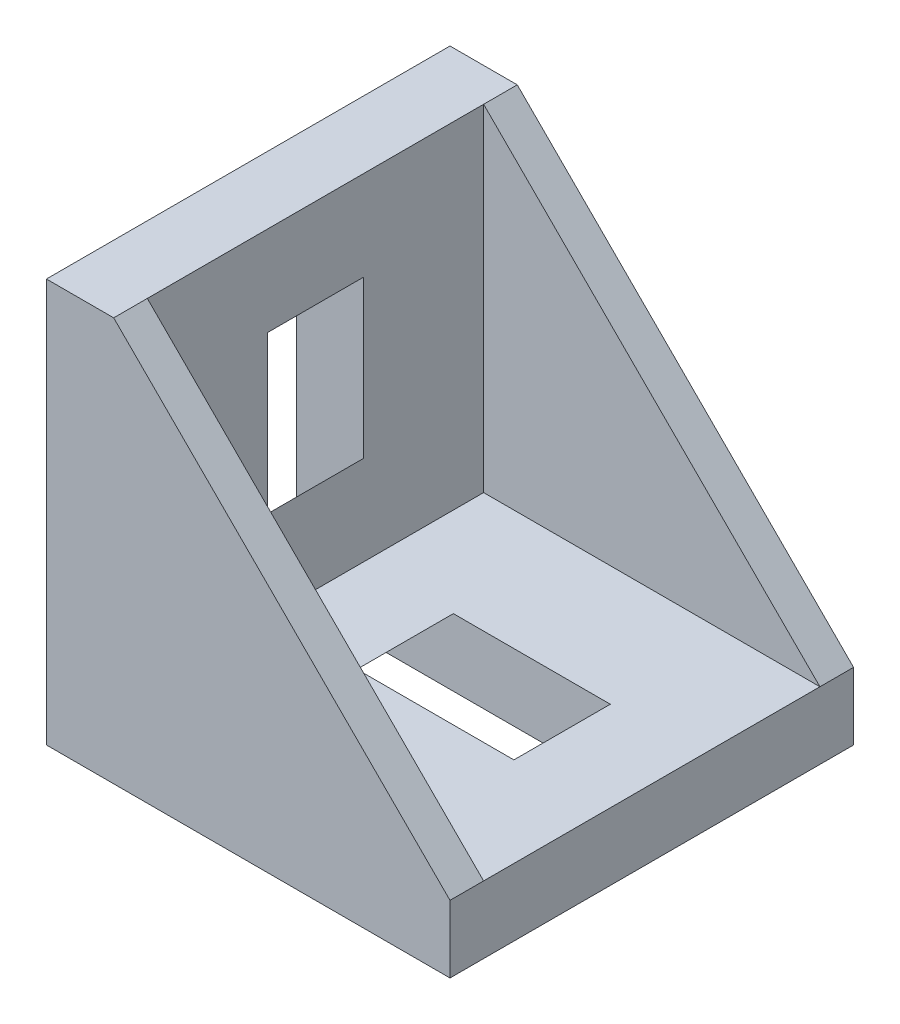
ISO-10303-21;
HEADER;
FILE_DESCRIPTION(('STEP AP214'),'2;1');
FILE_NAME('part.step','',(''),(''),'','','');
FILE_SCHEMA(('AUTOMOTIVE_DESIGN { 1 0 10303 214 1 1 1 1 }'));
ENDSEC;
DATA;
#1=APPLICATION_CONTEXT('core data for automotive mechanical design processes');
#2=APPLICATION_PROTOCOL_DEFINITION('international standard','automotive_design',2000,#1);
#3=PRODUCT_CONTEXT('',#1,'mechanical');
#4=PRODUCT('Part','Part','',(#3));
#5=PRODUCT_RELATED_PRODUCT_CATEGORY('part','',(#4));
#6=PRODUCT_DEFINITION_FORMATION('','',#4);
#7=PRODUCT_DEFINITION_CONTEXT('part definition',#1,'design');
#8=PRODUCT_DEFINITION('design','',#6,#7);
#9=PRODUCT_DEFINITION_SHAPE('','',#8);
#10=(LENGTH_UNIT() NAMED_UNIT(*) SI_UNIT(.MILLI.,.METRE.));
#11=(NAMED_UNIT(*) PLANE_ANGLE_UNIT() SI_UNIT($,.RADIAN.));
#12=(NAMED_UNIT(*) SI_UNIT($,.STERADIAN.) SOLID_ANGLE_UNIT());
#13=UNCERTAINTY_MEASURE_WITH_UNIT(LENGTH_MEASURE(1.E-05),#10,'distance_accuracy_value','');
#14=(GEOMETRIC_REPRESENTATION_CONTEXT(3) GLOBAL_UNCERTAINTY_ASSIGNED_CONTEXT((#13)) GLOBAL_UNIT_ASSIGNED_CONTEXT((#10,
#11,#12)) REPRESENTATION_CONTEXT('',''));
#15=CARTESIAN_POINT('',(0.,0.,0.));
#16=DIRECTION('',(0.,0.,1.));
#17=DIRECTION('',(1.,0.,0.));
#18=AXIS2_PLACEMENT_3D('',#15,#16,#17);
#19=CARTESIAN_POINT('',(0.,0.,9.));
#20=DIRECTION('',(1.,0.,0.));
#21=DIRECTION('',(0.,0.,-1.));
#22=AXIS2_PLACEMENT_3D('',#19,#20,#21);
#23=PLANE('',#22);
#24=DIRECTION('',(0.,0.,-1.));
#25=VECTOR('',#24,1.);
#26=CARTESIAN_POINT('',(0.,17.3,2.5));
#27=LINE('',#26,#25);
#28=CARTESIAN_POINT('',(0.,17.3,2.5));
#29=VERTEX_POINT('',#28);
#30=CARTESIAN_POINT('',(0.,17.3,-2.5));
#31=VERTEX_POINT('',#30);
#32=EDGE_CURVE('E288',#29,#31,#27,.T.);
#33=ORIENTED_EDGE('',*,*,#32,.F.);
#34=DIRECTION('',(0.,1.,0.));
#35=VECTOR('',#34,1.);
#36=CARTESIAN_POINT('',(0.,17.3,2.5));
#37=LINE('',#36,#35);
#38=CARTESIAN_POINT('',(0.,14.9992165715514,2.5));
#39=VERTEX_POINT('',#38);
#40=EDGE_CURVE('E285',#39,#29,#37,.T.);
#41=ORIENTED_EDGE('',*,*,#40,.F.);
#42=DIRECTION('',(0.,0.,-1.));
#43=VECTOR('',#42,1.);
#44=CARTESIAN_POINT('',(0.,14.9992165715514,2.5));
#45=LINE('',#44,#43);
#46=CARTESIAN_POINT('',(0.,14.9992165715514,-2.5));
#47=VERTEX_POINT('',#46);
#48=EDGE_CURVE('E299',#39,#47,#45,.T.);
#49=ORIENTED_EDGE('',*,*,#48,.T.);
#50=DIRECTION('',(0.,1.,0.));
#51=VECTOR('',#50,1.);
#52=CARTESIAN_POINT('',(0.,17.3,-2.5));
#53=LINE('',#52,#51);
#54=EDGE_CURVE('E280',#47,#31,#53,.T.);
#55=ORIENTED_EDGE('',*,*,#54,.T.);
#56=EDGE_LOOP('',(#33,#41,#49,#55));
#57=FACE_BOUND('',#56,.T.);
#58=DIRECTION('',(0.,-1.,0.));
#59=VECTOR('',#58,1.);
#60=CARTESIAN_POINT('',(0.,14.,-2.15));
#61=LINE('',#60,#59);
#62=CARTESIAN_POINT('',(0.,14.,-2.15));
#63=VERTEX_POINT('',#62);
#64=CARTESIAN_POINT('',(0.,4.,-2.15));
#65=VERTEX_POINT('',#64);
#66=EDGE_CURVE('E402',#63,#65,#61,.T.);
#67=ORIENTED_EDGE('',*,*,#66,.F.);
#68=DIRECTION('',(0.,0.,1.));
#69=VECTOR('',#68,1.);
#70=CARTESIAN_POINT('',(0.,14.,-2.15));
#71=LINE('',#70,#69);
#72=CARTESIAN_POINT('',(0.,14.,2.15));
#73=VERTEX_POINT('',#72);
#74=EDGE_CURVE('E425',#63,#73,#71,.T.);
#75=ORIENTED_EDGE('',*,*,#74,.T.);
#76=DIRECTION('',(0.,-1.,0.));
#77=VECTOR('',#76,1.);
#78=CARTESIAN_POINT('',(0.,14.,2.15));
#79=LINE('',#78,#77);
#80=CARTESIAN_POINT('',(0.,4.,2.15));
#81=VERTEX_POINT('',#80);
#82=EDGE_CURVE('E393',#73,#81,#79,.T.);
#83=ORIENTED_EDGE('',*,*,#82,.T.);
#84=DIRECTION('',(0.,0.,1.));
#85=VECTOR('',#84,1.);
#86=CARTESIAN_POINT('',(0.,4.,-2.15));
#87=LINE('',#86,#85);
#88=EDGE_CURVE('E414',#65,#81,#87,.T.);
#89=ORIENTED_EDGE('',*,*,#88,.F.);
#90=EDGE_LOOP('',(#67,#75,#83,#89));
#91=FACE_BOUND('',#90,.T.);
#92=DIRECTION('',(0.,-1.,0.));
#93=VECTOR('',#92,1.);
#94=CARTESIAN_POINT('',(0.,0.,-9.));
#95=LINE('',#94,#93);
#96=CARTESIAN_POINT('',(0.,18.,-9.));
#97=VERTEX_POINT('',#96);
#98=CARTESIAN_POINT('',(0.,0.,-9.));
#99=VERTEX_POINT('',#98);
#100=EDGE_CURVE('E465',#97,#99,#95,.T.);
#101=ORIENTED_EDGE('',*,*,#100,.T.);
#102=DIRECTION('',(0.,0.,-1.));
#103=VECTOR('',#102,1.);
#104=CARTESIAN_POINT('',(0.,0.,9.));
#105=LINE('',#104,#103);
#106=CARTESIAN_POINT('',(0.,0.,9.));
#107=VERTEX_POINT('',#106);
#108=EDGE_CURVE('E473',#107,#99,#105,.T.);
#109=ORIENTED_EDGE('',*,*,#108,.F.);
#110=DIRECTION('',(0.,-1.,0.));
#111=VECTOR('',#110,1.);
#112=CARTESIAN_POINT('',(0.,0.,9.));
#113=LINE('',#112,#111);
#114=CARTESIAN_POINT('',(0.,18.,9.));
#115=VERTEX_POINT('',#114);
#116=EDGE_CURVE('E471',#115,#107,#113,.T.);
#117=ORIENTED_EDGE('',*,*,#116,.F.);
#118=DIRECTION('',(0.,0.,-1.));
#119=VECTOR('',#118,1.);
#120=CARTESIAN_POINT('',(0.,18.,9.));
#121=LINE('',#120,#119);
#122=EDGE_CURVE('E487',#115,#97,#121,.T.);
#123=ORIENTED_EDGE('',*,*,#122,.T.);
#124=EDGE_LOOP('',(#101,#109,#117,#123));
#125=FACE_BOUND('',#124,.T.);
#126=DIRECTION('',(0.,1.,0.));
#127=VECTOR('',#126,1.);
#128=CARTESIAN_POINT('',(0.,1.23475047748417,2.5));
#129=LINE('',#128,#127);
#130=CARTESIAN_POINT('',(0.,1.23475047748417,2.5));
#131=VERTEX_POINT('',#130);
#132=CARTESIAN_POINT('',(0.,3.53553390593273,2.5));
#133=VERTEX_POINT('',#132);
#134=EDGE_CURVE('E308',#131,#133,#129,.T.);
#135=ORIENTED_EDGE('',*,*,#134,.F.);
#136=DIRECTION('',(0.,0.,-1.));
#137=VECTOR('',#136,1.);
#138=CARTESIAN_POINT('',(0.,1.23475047748417,2.5));
#139=LINE('',#138,#137);
#140=CARTESIAN_POINT('',(0.,1.23475047748417,-2.5));
#141=VERTEX_POINT('',#140);
#142=EDGE_CURVE('E318',#131,#141,#139,.T.);
#143=ORIENTED_EDGE('',*,*,#142,.T.);
#144=DIRECTION('',(0.,1.,0.));
#145=VECTOR('',#144,1.);
#146=CARTESIAN_POINT('',(0.,1.23475047748417,-2.5));
#147=LINE('',#146,#145);
#148=CARTESIAN_POINT('',(0.,3.53553390593273,-2.5));
#149=VERTEX_POINT('',#148);
#150=EDGE_CURVE('E307',#141,#149,#147,.T.);
#151=ORIENTED_EDGE('',*,*,#150,.T.);
#152=DIRECTION('',(0.,0.,-1.));
#153=VECTOR('',#152,1.);
#154=CARTESIAN_POINT('',(0.,3.53553390593273,2.5));
#155=LINE('',#154,#153);
#156=EDGE_CURVE('E334',#133,#149,#155,.T.);
#157=ORIENTED_EDGE('',*,*,#156,.F.);
#158=EDGE_LOOP('',(#135,#143,#151,#157));
#159=FACE_BOUND('',#158,.T.);
#160=ADVANCED_FACE('F32',(#57,#91,#125,#159),#23,.F.);
#161=CARTESIAN_POINT('',(18.,0.,9.));
#162=DIRECTION('',(0.,1.,0.));
#163=DIRECTION('',(-1.,0.,0.));
#164=AXIS2_PLACEMENT_3D('',#161,#162,#163);
#165=PLANE('',#164);
#166=DIRECTION('',(0.,0.,-1.));
#167=VECTOR('',#166,1.);
#168=CARTESIAN_POINT('',(14.9992165715514,0.,2.5));
#169=LINE('',#168,#167);
#170=CARTESIAN_POINT('',(14.9992165715514,0.,2.5));
#171=VERTEX_POINT('',#170);
#172=CARTESIAN_POINT('',(14.9992165715514,0.,-2.5));
#173=VERTEX_POINT('',#172);
#174=EDGE_CURVE('E47',#171,#173,#169,.T.);
#175=ORIENTED_EDGE('',*,*,#174,.F.);
#176=DIRECTION('',(-1.,0.,0.));
#177=VECTOR('',#176,1.);
#178=CARTESIAN_POINT('',(17.3,0.,2.5));
#179=LINE('',#178,#177);
#180=CARTESIAN_POINT('',(17.3,0.,2.5));
#181=VERTEX_POINT('',#180);
#182=EDGE_CURVE('E52',#181,#171,#179,.T.);
#183=ORIENTED_EDGE('',*,*,#182,.F.);
#184=DIRECTION('',(0.,0.,-1.));
#185=VECTOR('',#184,1.);
#186=CARTESIAN_POINT('',(17.3,0.,2.5));
#187=LINE('',#186,#185);
#188=CARTESIAN_POINT('',(17.3,0.,-2.5));
#189=VERTEX_POINT('',#188);
#190=EDGE_CURVE('E260',#181,#189,#187,.T.);
#191=ORIENTED_EDGE('',*,*,#190,.T.);
#192=DIRECTION('',(-1.,0.,0.));
#193=VECTOR('',#192,1.);
#194=CARTESIAN_POINT('',(17.3,0.,-2.5));
#195=LINE('',#194,#193);
#196=EDGE_CURVE('E264',#189,#173,#195,.T.);
#197=ORIENTED_EDGE('',*,*,#196,.T.);
#198=EDGE_LOOP('',(#175,#183,#191,#197));
#199=FACE_BOUND('',#198,.T.);
#200=DIRECTION('',(1.,0.,0.));
#201=VECTOR('',#200,1.);
#202=CARTESIAN_POINT('',(4.,0.,-2.15));
#203=LINE('',#202,#201);
#204=CARTESIAN_POINT('',(4.,0.,-2.15));
#205=VERTEX_POINT('',#204);
#206=CARTESIAN_POINT('',(14.,0.,-2.15));
#207=VERTEX_POINT('',#206);
#208=EDGE_CURVE('E370',#205,#207,#203,.T.);
#209=ORIENTED_EDGE('',*,*,#208,.F.);
#210=DIRECTION('',(0.,0.,1.));
#211=VECTOR('',#210,1.);
#212=CARTESIAN_POINT('',(4.,0.,-2.15));
#213=LINE('',#212,#211);
#214=CARTESIAN_POINT('',(4.,0.,2.15));
#215=VERTEX_POINT('',#214);
#216=EDGE_CURVE('E380',#205,#215,#213,.T.);
#217=ORIENTED_EDGE('',*,*,#216,.T.);
#218=DIRECTION('',(1.,0.,0.));
#219=VECTOR('',#218,1.);
#220=CARTESIAN_POINT('',(4.,0.,2.15));
#221=LINE('',#220,#219);
#222=CARTESIAN_POINT('',(14.,0.,2.15));
#223=VERTEX_POINT('',#222);
#224=EDGE_CURVE('E383',#215,#223,#221,.T.);
#225=ORIENTED_EDGE('',*,*,#224,.T.);
#226=DIRECTION('',(0.,0.,1.));
#227=VECTOR('',#226,1.);
#228=CARTESIAN_POINT('',(14.,0.,-2.15));
#229=LINE('',#228,#227);
#230=EDGE_CURVE('E397',#207,#223,#229,.T.);
#231=ORIENTED_EDGE('',*,*,#230,.F.);
#232=EDGE_LOOP('',(#209,#217,#225,#231));
#233=FACE_BOUND('',#232,.T.);
#234=DIRECTION('',(1.,0.,0.));
#235=VECTOR('',#234,1.);
#236=CARTESIAN_POINT('',(18.,0.,-9.));
#237=LINE('',#236,#235);
#238=CARTESIAN_POINT('',(18.,0.,-9.));
#239=VERTEX_POINT('',#238);
#240=EDGE_CURVE('E457',#99,#239,#237,.T.);
#241=ORIENTED_EDGE('',*,*,#240,.T.);
#242=DIRECTION('',(0.,0.,-1.));
#243=VECTOR('',#242,1.);
#244=CARTESIAN_POINT('',(18.,0.,9.));
#245=LINE('',#244,#243);
#246=CARTESIAN_POINT('',(18.,0.,9.));
#247=VERTEX_POINT('',#246);
#248=EDGE_CURVE('E11',#247,#239,#245,.T.);
#249=ORIENTED_EDGE('',*,*,#248,.F.);
#250=DIRECTION('',(1.,0.,0.));
#251=VECTOR('',#250,1.);
#252=CARTESIAN_POINT('',(18.,0.,9.));
#253=LINE('',#252,#251);
#254=EDGE_CURVE('E461',#107,#247,#253,.T.);
#255=ORIENTED_EDGE('',*,*,#254,.F.);
#256=ORIENTED_EDGE('',*,*,#108,.T.);
#257=EDGE_LOOP('',(#241,#249,#255,#256));
#258=FACE_BOUND('',#257,.T.);
#259=DIRECTION('',(-1.,0.,0.));
#260=VECTOR('',#259,1.);
#261=CARTESIAN_POINT('',(1.23475047748409,0.,2.5));
#262=LINE('',#261,#260);
#263=CARTESIAN_POINT('',(3.53553390593274,0.,2.5));
#264=VERTEX_POINT('',#263);
#265=CARTESIAN_POINT('',(1.23475047748409,0.,2.5));
#266=VERTEX_POINT('',#265);
#267=EDGE_CURVE('E339',#264,#266,#262,.T.);
#268=ORIENTED_EDGE('',*,*,#267,.F.);
#269=DIRECTION('',(0.,0.,-1.));
#270=VECTOR('',#269,1.);
#271=CARTESIAN_POINT('',(3.53553390593274,0.,2.5));
#272=LINE('',#271,#270);
#273=CARTESIAN_POINT('',(3.53553390593274,0.,-2.5));
#274=VERTEX_POINT('',#273);
#275=EDGE_CURVE('E363',#264,#274,#272,.T.);
#276=ORIENTED_EDGE('',*,*,#275,.T.);
#277=DIRECTION('',(-1.,0.,0.));
#278=VECTOR('',#277,1.);
#279=CARTESIAN_POINT('',(1.23475047748409,0.,-2.5));
#280=LINE('',#279,#278);
#281=CARTESIAN_POINT('',(1.23475047748409,0.,-2.5));
#282=VERTEX_POINT('',#281);
#283=EDGE_CURVE('E349',#274,#282,#280,.T.);
#284=ORIENTED_EDGE('',*,*,#283,.T.);
#285=DIRECTION('',(0.,0.,-1.));
#286=VECTOR('',#285,1.);
#287=CARTESIAN_POINT('',(1.23475047748409,0.,2.5));
#288=LINE('',#287,#286);
#289=EDGE_CURVE('E360',#266,#282,#288,.T.);
#290=ORIENTED_EDGE('',*,*,#289,.F.);
#291=EDGE_LOOP('',(#268,#276,#284,#290));
#292=FACE_BOUND('',#291,.T.);
#293=ADVANCED_FACE('F34',(#199,#233,#258,#292),#165,.F.);
#294=CARTESIAN_POINT('',(3.,3.,-7.5));
#295=DIRECTION('',(0.,-1.,0.));
#296=DIRECTION('',(0.,0.,-1.));
#297=AXIS2_PLACEMENT_3D('',#294,#295,#296);
#298=PLANE('',#297);
#299=DIRECTION('',(1.,0.,0.));
#300=VECTOR('',#299,1.);
#301=CARTESIAN_POINT('',(3.,3.,7.5));
#302=LINE('',#301,#300);
#303=CARTESIAN_POINT('',(3.,3.,7.5));
#304=VERTEX_POINT('',#303);
#305=CARTESIAN_POINT('',(18.,3.,7.5));
#306=VERTEX_POINT('',#305);
#307=EDGE_CURVE('E440',#304,#306,#302,.T.);
#308=ORIENTED_EDGE('',*,*,#307,.T.);
#309=DIRECTION('',(0.,0.,1.));
#310=VECTOR('',#309,1.);
#311=CARTESIAN_POINT('',(18.,3.,-7.5));
#312=LINE('',#311,#310);
#313=CARTESIAN_POINT('',(18.,3.,-7.5));
#314=VERTEX_POINT('',#313);
#315=EDGE_CURVE('E454',#314,#306,#312,.T.);
#316=ORIENTED_EDGE('',*,*,#315,.F.);
#317=DIRECTION('',(1.,0.,0.));
#318=VECTOR('',#317,1.);
#319=CARTESIAN_POINT('',(3.,3.,-7.5));
#320=LINE('',#319,#318);
#321=CARTESIAN_POINT('',(3.,3.,-7.5));
#322=VERTEX_POINT('',#321);
#323=EDGE_CURVE('E443',#322,#314,#320,.T.);
#324=ORIENTED_EDGE('',*,*,#323,.F.);
#325=DIRECTION('',(0.,0.,1.));
#326=VECTOR('',#325,1.);
#327=CARTESIAN_POINT('',(3.,3.,-7.5));
#328=LINE('',#327,#326);
#329=EDGE_CURVE('E458',#322,#304,#328,.T.);
#330=ORIENTED_EDGE('',*,*,#329,.T.);
#331=EDGE_LOOP('',(#308,#316,#324,#330));
#332=FACE_BOUND('',#331,.T.);
#333=DIRECTION('',(-1.,0.,0.));
#334=VECTOR('',#333,1.);
#335=CARTESIAN_POINT('',(7.,3.,-2.15));
#336=LINE('',#335,#334);
#337=CARTESIAN_POINT('',(14.,3.,-2.15));
#338=VERTEX_POINT('',#337);
#339=CARTESIAN_POINT('',(7.,3.,-2.15));
#340=VERTEX_POINT('',#339);
#341=EDGE_CURVE('E377',#338,#340,#336,.T.);
#342=ORIENTED_EDGE('',*,*,#341,.F.);
#343=DIRECTION('',(0.,0.,1.));
#344=VECTOR('',#343,1.);
#345=CARTESIAN_POINT('',(14.,3.,-2.15));
#346=LINE('',#345,#344);
#347=CARTESIAN_POINT('',(14.,3.,2.15));
#348=VERTEX_POINT('',#347);
#349=EDGE_CURVE('E394',#338,#348,#346,.T.);
#350=ORIENTED_EDGE('',*,*,#349,.T.);
#351=DIRECTION('',(-1.,0.,0.));
#352=VECTOR('',#351,1.);
#353=CARTESIAN_POINT('',(7.,3.,2.15));
#354=LINE('',#353,#352);
#355=CARTESIAN_POINT('',(7.,3.,2.15));
#356=VERTEX_POINT('',#355);
#357=EDGE_CURVE('E371',#348,#356,#354,.T.);
#358=ORIENTED_EDGE('',*,*,#357,.T.);
#359=DIRECTION('',(0.,0.,1.));
#360=VECTOR('',#359,1.);
#361=CARTESIAN_POINT('',(7.,3.,-2.15));
#362=LINE('',#361,#360);
#363=EDGE_CURVE('E390',#340,#356,#362,.T.);
#364=ORIENTED_EDGE('',*,*,#363,.F.);
#365=EDGE_LOOP('',(#342,#350,#358,#364));
#366=FACE_BOUND('',#365,.T.);
#367=ADVANCED_FACE('F531',(#332,#366),#298,.F.);
#368=CARTESIAN_POINT('',(3.,18.,-7.5));
#369=DIRECTION('',(-1.,0.,0.));
#370=DIRECTION('',(0.,-1.,0.));
#371=AXIS2_PLACEMENT_3D('',#368,#369,#370);
#372=PLANE('',#371);
#373=DIRECTION('',(0.,-1.,0.));
#374=VECTOR('',#373,1.);
#375=CARTESIAN_POINT('',(3.,18.,7.5));
#376=LINE('',#375,#374);
#377=CARTESIAN_POINT('',(3.,18.,7.5));
#378=VERTEX_POINT('',#377);
#379=EDGE_CURVE('E449',#378,#304,#376,.T.);
#380=ORIENTED_EDGE('',*,*,#379,.T.);
#381=ORIENTED_EDGE('',*,*,#329,.F.);
#382=DIRECTION('',(0.,-1.,0.));
#383=VECTOR('',#382,1.);
#384=CARTESIAN_POINT('',(3.,18.,-7.5));
#385=LINE('',#384,#383);
#386=CARTESIAN_POINT('',(3.,18.,-7.5));
#387=VERTEX_POINT('',#386);
#388=EDGE_CURVE('E439',#387,#322,#385,.T.);
#389=ORIENTED_EDGE('',*,*,#388,.F.);
#390=DIRECTION('',(0.,0.,1.));
#391=VECTOR('',#390,1.);
#392=CARTESIAN_POINT('',(3.,18.,-7.5));
#393=LINE('',#392,#391);
#394=EDGE_CURVE('E446',#387,#378,#393,.T.);
#395=ORIENTED_EDGE('',*,*,#394,.T.);
#396=EDGE_LOOP('',(#380,#381,#389,#395));
#397=FACE_BOUND('',#396,.T.);
#398=DIRECTION('',(0.,1.,0.));
#399=VECTOR('',#398,1.);
#400=CARTESIAN_POINT('',(3.,14.,-2.15));
#401=LINE('',#400,#399);
#402=CARTESIAN_POINT('',(3.,7.,-2.15));
#403=VERTEX_POINT('',#402);
#404=CARTESIAN_POINT('',(3.,14.,-2.15));
#405=VERTEX_POINT('',#404);
#406=EDGE_CURVE('E409',#403,#405,#401,.T.);
#407=ORIENTED_EDGE('',*,*,#406,.F.);
#408=DIRECTION('',(0.,0.,1.));
#409=VECTOR('',#408,1.);
#410=CARTESIAN_POINT('',(3.,7.,-2.15));
#411=LINE('',#410,#409);
#412=CARTESIAN_POINT('',(3.,7.,2.15));
#413=VERTEX_POINT('',#412);
#414=EDGE_CURVE('E432',#403,#413,#411,.T.);
#415=ORIENTED_EDGE('',*,*,#414,.T.);
#416=DIRECTION('',(0.,1.,0.));
#417=VECTOR('',#416,1.);
#418=CARTESIAN_POINT('',(3.,14.,2.15));
#419=LINE('',#418,#417);
#420=CARTESIAN_POINT('',(3.,14.,2.15));
#421=VERTEX_POINT('',#420);
#422=EDGE_CURVE('E420',#413,#421,#419,.T.);
#423=ORIENTED_EDGE('',*,*,#422,.T.);
#424=DIRECTION('',(0.,0.,1.));
#425=VECTOR('',#424,1.);
#426=CARTESIAN_POINT('',(3.,14.,-2.15));
#427=LINE('',#426,#425);
#428=EDGE_CURVE('E429',#405,#421,#427,.T.);
#429=ORIENTED_EDGE('',*,*,#428,.F.);
#430=EDGE_LOOP('',(#407,#415,#423,#429));
#431=FACE_BOUND('',#430,.T.);
#432=ADVANCED_FACE('F536',(#397,#431),#372,.F.);
#433=CARTESIAN_POINT('',(18.,3.,9.));
#434=DIRECTION('',(-0.707106781186547,-0.707106781186547,0.));
#435=DIRECTION('',(0.707106781186548,-0.707106781186548,0.));
#436=AXIS2_PLACEMENT_3D('',#433,#434,#435);
#437=PLANE('',#436);
#438=DIRECTION('',(-0.707106781186547,0.707106781186547,0.));
#439=VECTOR('',#438,1.);
#440=CARTESIAN_POINT('',(3.,18.,-7.5));
#441=LINE('',#440,#439);
#442=EDGE_CURVE('E437',#314,#387,#441,.T.);
#443=ORIENTED_EDGE('',*,*,#442,.F.);
#444=DIRECTION('',(0.,0.,-1.));
#445=VECTOR('',#444,1.);
#446=CARTESIAN_POINT('',(18.,3.,9.));
#447=LINE('',#446,#445);
#448=CARTESIAN_POINT('',(18.,3.,-9.));
#449=VERTEX_POINT('',#448);
#450=EDGE_CURVE('E493',#314,#449,#447,.T.);
#451=ORIENTED_EDGE('',*,*,#450,.T.);
#452=DIRECTION('',(-0.707106781186547,0.707106781186547,0.));
#453=VECTOR('',#452,1.);
#454=CARTESIAN_POINT('',(18.,3.,-9.));
#455=LINE('',#454,#453);
#456=CARTESIAN_POINT('',(3.,18.,-9.));
#457=VERTEX_POINT('',#456);
#458=EDGE_CURVE('E479',#449,#457,#455,.T.);
#459=ORIENTED_EDGE('',*,*,#458,.T.);
#460=DIRECTION('',(0.,0.,-1.));
#461=VECTOR('',#460,1.);
#462=CARTESIAN_POINT('',(3.,18.,9.));
#463=LINE('',#462,#461);
#464=EDGE_CURVE('E490',#387,#457,#463,.T.);
#465=ORIENTED_EDGE('',*,*,#464,.F.);
#466=EDGE_LOOP('',(#443,#451,#459,#465));
#467=FACE_BOUND('',#466,.T.);
#468=ADVANCED_FACE('F501',(#467),#437,.F.);
#469=CARTESIAN_POINT('',(18.,3.,9.));
#470=DIRECTION('',(-1.,0.,0.));
#471=DIRECTION('',(0.,0.,1.));
#472=AXIS2_PLACEMENT_3D('',#469,#470,#471);
#473=PLANE('',#472);
#474=DIRECTION('',(0.,1.,0.));
#475=VECTOR('',#474,1.);
#476=CARTESIAN_POINT('',(18.,3.,-9.));
#477=LINE('',#476,#475);
#478=EDGE_CURVE('E476',#239,#449,#477,.T.);
#479=ORIENTED_EDGE('',*,*,#478,.T.);
#480=ORIENTED_EDGE('',*,*,#450,.F.);
#481=ORIENTED_EDGE('',*,*,#315,.T.);
#482=CARTESIAN_POINT('',(18.,3.,9.));
#483=VERTEX_POINT('',#482);
#484=EDGE_CURVE('E40',#483,#306,#447,.T.);
#485=ORIENTED_EDGE('',*,*,#484,.F.);
#486=DIRECTION('',(0.,1.,0.));
#487=VECTOR('',#486,1.);
#488=CARTESIAN_POINT('',(18.,3.,9.));
#489=LINE('',#488,#487);
#490=EDGE_CURVE('E464',#247,#483,#489,.T.);
#491=ORIENTED_EDGE('',*,*,#490,.F.);
#492=ORIENTED_EDGE('',*,*,#248,.T.);
#493=EDGE_LOOP('',(#479,#480,#481,#485,#491,#492));
#494=FACE_BOUND('',#493,.T.);
#495=ADVANCED_FACE('F506',(#494),#473,.F.);
#496=ORIENTED_EDGE('',*,*,#484,.T.);
#497=DIRECTION('',(-0.707106781186547,0.707106781186547,0.));
#498=VECTOR('',#497,1.);
#499=CARTESIAN_POINT('',(3.,18.,7.5));
#500=LINE('',#499,#498);
#501=EDGE_CURVE('E428',#306,#378,#500,.T.);
#502=ORIENTED_EDGE('',*,*,#501,.T.);
#503=CARTESIAN_POINT('',(3.,18.,9.));
#504=VERTEX_POINT('',#503);
#505=EDGE_CURVE('E491',#504,#378,#463,.T.);
#506=ORIENTED_EDGE('',*,*,#505,.F.);
#507=DIRECTION('',(-0.707106781186547,0.707106781186547,0.));
#508=VECTOR('',#507,1.);
#509=CARTESIAN_POINT('',(18.,3.,9.));
#510=LINE('',#509,#508);
#511=EDGE_CURVE('E467',#483,#504,#510,.T.);
#512=ORIENTED_EDGE('',*,*,#511,.F.);
#513=EDGE_LOOP('',(#496,#502,#506,#512));
#514=FACE_BOUND('',#513,.T.);
#515=ADVANCED_FACE('F525',(#514),#437,.F.);
#516=CARTESIAN_POINT('',(3.,18.,9.));
#517=DIRECTION('',(0.,-1.,0.));
#518=DIRECTION('',(0.,0.,-1.));
#519=AXIS2_PLACEMENT_3D('',#516,#517,#518);
#520=PLANE('',#519);
#521=DIRECTION('',(-1.,0.,0.));
#522=VECTOR('',#521,1.);
#523=CARTESIAN_POINT('',(3.,18.,-9.));
#524=LINE('',#523,#522);
#525=EDGE_CURVE('E482',#457,#97,#524,.T.);
#526=ORIENTED_EDGE('',*,*,#525,.T.);
#527=ORIENTED_EDGE('',*,*,#122,.F.);
#528=DIRECTION('',(-1.,0.,0.));
#529=VECTOR('',#528,1.);
#530=CARTESIAN_POINT('',(3.,18.,9.));
#531=LINE('',#530,#529);
#532=EDGE_CURVE('E469',#504,#115,#531,.T.);
#533=ORIENTED_EDGE('',*,*,#532,.F.);
#534=ORIENTED_EDGE('',*,*,#505,.T.);
#535=ORIENTED_EDGE('',*,*,#394,.F.);
#536=ORIENTED_EDGE('',*,*,#464,.T.);
#537=EDGE_LOOP('',(#526,#527,#533,#534,#535,#536));
#538=FACE_BOUND('',#537,.T.);
#539=ADVANCED_FACE('F514',(#538),#520,.F.);
#540=CARTESIAN_POINT('',(0.,0.,9.));
#541=DIRECTION('',(0.,0.,-1.));
#542=DIRECTION('',(-1.,0.,0.));
#543=AXIS2_PLACEMENT_3D('',#540,#541,#542);
#544=PLANE('',#543);
#545=ORIENTED_EDGE('',*,*,#254,.T.);
#546=ORIENTED_EDGE('',*,*,#490,.T.);
#547=ORIENTED_EDGE('',*,*,#511,.T.);
#548=ORIENTED_EDGE('',*,*,#532,.T.);
#549=ORIENTED_EDGE('',*,*,#116,.T.);
#550=EDGE_LOOP('',(#545,#546,#547,#548,#549));
#551=FACE_BOUND('',#550,.T.);
#552=ADVANCED_FACE('F523',(#551),#544,.F.);
#553=CARTESIAN_POINT('',(0.,0.,-9.));
#554=DIRECTION('',(0.,0.,-1.));
#555=DIRECTION('',(-1.,0.,0.));
#556=AXIS2_PLACEMENT_3D('',#553,#554,#555);
#557=PLANE('',#556);
#558=ORIENTED_EDGE('',*,*,#240,.F.);
#559=ORIENTED_EDGE('',*,*,#100,.F.);
#560=ORIENTED_EDGE('',*,*,#525,.F.);
#561=ORIENTED_EDGE('',*,*,#458,.F.);
#562=ORIENTED_EDGE('',*,*,#478,.F.);
#563=EDGE_LOOP('',(#558,#559,#560,#561,#562));
#564=FACE_BOUND('',#563,.T.);
#565=ADVANCED_FACE('F510',(#564),#557,.T.);
#566=CARTESIAN_POINT('',(18.,3.,-7.5));
#567=DIRECTION('',(0.,0.,1.));
#568=DIRECTION('',(1.,0.,0.));
#569=AXIS2_PLACEMENT_3D('',#566,#567,#568);
#570=PLANE('',#569);
#571=ORIENTED_EDGE('',*,*,#442,.T.);
#572=ORIENTED_EDGE('',*,*,#388,.T.);
#573=ORIENTED_EDGE('',*,*,#323,.T.);
#574=EDGE_LOOP('',(#571,#572,#573));
#575=FACE_BOUND('',#574,.T.);
#576=ADVANCED_FACE('F539',(#575),#570,.T.);
#577=CARTESIAN_POINT('',(18.,3.,7.5));
#578=DIRECTION('',(0.,0.,1.));
#579=DIRECTION('',(1.,0.,0.));
#580=AXIS2_PLACEMENT_3D('',#577,#578,#579);
#581=PLANE('',#580);
#582=ORIENTED_EDGE('',*,*,#501,.F.);
#583=ORIENTED_EDGE('',*,*,#307,.F.);
#584=ORIENTED_EDGE('',*,*,#379,.F.);
#585=EDGE_LOOP('',(#582,#583,#584));
#586=FACE_BOUND('',#585,.T.);
#587=ADVANCED_FACE('F529',(#586),#581,.F.);
#588=CARTESIAN_POINT('',(0.,14.,-2.15));
#589=DIRECTION('',(0.,1.,0.));
#590=DIRECTION('',(0.,0.,1.));
#591=AXIS2_PLACEMENT_3D('',#588,#589,#590);
#592=PLANE('',#591);
#593=DIRECTION('',(-1.,0.,0.));
#594=VECTOR('',#593,1.);
#595=CARTESIAN_POINT('',(0.,14.,2.15));
#596=LINE('',#595,#594);
#597=EDGE_CURVE('E406',#421,#73,#596,.T.);
#598=ORIENTED_EDGE('',*,*,#597,.T.);
#599=ORIENTED_EDGE('',*,*,#74,.F.);
#600=DIRECTION('',(-1.,0.,0.));
#601=VECTOR('',#600,1.);
#602=CARTESIAN_POINT('',(0.,14.,-2.15));
#603=LINE('',#602,#601);
#604=EDGE_CURVE('E411',#405,#63,#603,.T.);
#605=ORIENTED_EDGE('',*,*,#604,.F.);
#606=ORIENTED_EDGE('',*,*,#428,.T.);
#607=EDGE_LOOP('',(#598,#599,#605,#606));
#608=FACE_BOUND('',#607,.T.);
#609=ADVANCED_FACE('F546',(#608),#592,.F.);
#610=CARTESIAN_POINT('',(0.,4.,-2.15));
#611=DIRECTION('',(0.707106781186548,-0.707106781186547,0.));
#612=DIRECTION('',(0.707106781186547,0.707106781186548,0.));
#613=AXIS2_PLACEMENT_3D('',#610,#611,#612);
#614=PLANE('',#613);
#615=DIRECTION('',(0.707106781186547,0.707106781186548,0.));
#616=VECTOR('',#615,1.);
#617=CARTESIAN_POINT('',(0.,4.,2.15));
#618=LINE('',#617,#616);
#619=EDGE_CURVE('E417',#81,#413,#618,.T.);
#620=ORIENTED_EDGE('',*,*,#619,.T.);
#621=ORIENTED_EDGE('',*,*,#414,.F.);
#622=DIRECTION('',(0.707106781186547,0.707106781186548,0.));
#623=VECTOR('',#622,1.);
#624=CARTESIAN_POINT('',(0.,4.,-2.15));
#625=LINE('',#624,#623);
#626=EDGE_CURVE('E405',#65,#403,#625,.T.);
#627=ORIENTED_EDGE('',*,*,#626,.F.);
#628=ORIENTED_EDGE('',*,*,#88,.T.);
#629=EDGE_LOOP('',(#620,#621,#627,#628));
#630=FACE_BOUND('',#629,.T.);
#631=ADVANCED_FACE('F630',(#630),#614,.F.);
#632=CARTESIAN_POINT('',(0.,14.,-2.15));
#633=DIRECTION('',(0.,0.,1.));
#634=DIRECTION('',(1.,0.,0.));
#635=AXIS2_PLACEMENT_3D('',#632,#633,#634);
#636=PLANE('',#635);
#637=ORIENTED_EDGE('',*,*,#66,.T.);
#638=ORIENTED_EDGE('',*,*,#626,.T.);
#639=ORIENTED_EDGE('',*,*,#406,.T.);
#640=ORIENTED_EDGE('',*,*,#604,.T.);
#641=EDGE_LOOP('',(#637,#638,#639,#640));
#642=FACE_BOUND('',#641,.T.);
#643=ADVANCED_FACE('F640',(#642),#636,.T.);
#644=CARTESIAN_POINT('',(0.,14.,2.15));
#645=DIRECTION('',(0.,0.,1.));
#646=DIRECTION('',(1.,0.,0.));
#647=AXIS2_PLACEMENT_3D('',#644,#645,#646);
#648=PLANE('',#647);
#649=ORIENTED_EDGE('',*,*,#82,.F.);
#650=ORIENTED_EDGE('',*,*,#597,.F.);
#651=ORIENTED_EDGE('',*,*,#422,.F.);
#652=ORIENTED_EDGE('',*,*,#619,.F.);
#653=EDGE_LOOP('',(#649,#650,#651,#652));
#654=FACE_BOUND('',#653,.T.);
#655=ADVANCED_FACE('F649',(#654),#648,.F.);
#656=CARTESIAN_POINT('',(7.,3.,-2.15));
#657=DIRECTION('',(-0.707106781186548,0.707106781186547,0.));
#658=DIRECTION('',(-0.707106781186547,-0.707106781186548,0.));
#659=AXIS2_PLACEMENT_3D('',#656,#657,#658);
#660=PLANE('',#659);
#661=DIRECTION('',(-0.707106781186547,-0.707106781186548,0.));
#662=VECTOR('',#661,1.);
#663=CARTESIAN_POINT('',(7.,3.,2.15));
#664=LINE('',#663,#662);
#665=EDGE_CURVE('E366',#356,#215,#664,.T.);
#666=ORIENTED_EDGE('',*,*,#665,.T.);
#667=ORIENTED_EDGE('',*,*,#216,.F.);
#668=DIRECTION('',(-0.707106781186547,-0.707106781186548,0.));
#669=VECTOR('',#668,1.);
#670=CARTESIAN_POINT('',(7.,3.,-2.15));
#671=LINE('',#670,#669);
#672=EDGE_CURVE('E367',#340,#205,#671,.T.);
#673=ORIENTED_EDGE('',*,*,#672,.F.);
#674=ORIENTED_EDGE('',*,*,#363,.T.);
#675=EDGE_LOOP('',(#666,#667,#673,#674));
#676=FACE_BOUND('',#675,.T.);
#677=ADVANCED_FACE('F659',(#676),#660,.F.);
#678=CARTESIAN_POINT('',(14.,3.,-2.15));
#679=DIRECTION('',(1.,0.,0.));
#680=DIRECTION('',(0.,0.,-1.));
#681=AXIS2_PLACEMENT_3D('',#678,#679,#680);
#682=PLANE('',#681);
#683=DIRECTION('',(0.,1.,0.));
#684=VECTOR('',#683,1.);
#685=CARTESIAN_POINT('',(14.,3.,2.15));
#686=LINE('',#685,#684);
#687=EDGE_CURVE('E386',#223,#348,#686,.T.);
#688=ORIENTED_EDGE('',*,*,#687,.T.);
#689=ORIENTED_EDGE('',*,*,#349,.F.);
#690=DIRECTION('',(0.,1.,0.));
#691=VECTOR('',#690,1.);
#692=CARTESIAN_POINT('',(14.,3.,-2.15));
#693=LINE('',#692,#691);
#694=EDGE_CURVE('E374',#207,#338,#693,.T.);
#695=ORIENTED_EDGE('',*,*,#694,.F.);
#696=ORIENTED_EDGE('',*,*,#230,.T.);
#697=EDGE_LOOP('',(#688,#689,#695,#696));
#698=FACE_BOUND('',#697,.T.);
#699=ADVANCED_FACE('F669',(#698),#682,.F.);
#700=CARTESIAN_POINT('',(4.,0.,-2.15));
#701=DIRECTION('',(0.,0.,1.));
#702=DIRECTION('',(1.,0.,0.));
#703=AXIS2_PLACEMENT_3D('',#700,#701,#702);
#704=PLANE('',#703);
#705=ORIENTED_EDGE('',*,*,#672,.T.);
#706=ORIENTED_EDGE('',*,*,#208,.T.);
#707=ORIENTED_EDGE('',*,*,#694,.T.);
#708=ORIENTED_EDGE('',*,*,#341,.T.);
#709=EDGE_LOOP('',(#705,#706,#707,#708));
#710=FACE_BOUND('',#709,.T.);
#711=ADVANCED_FACE('F679',(#710),#704,.T.);
#712=CARTESIAN_POINT('',(4.,0.,2.15));
#713=DIRECTION('',(0.,0.,1.));
#714=DIRECTION('',(1.,0.,0.));
#715=AXIS2_PLACEMENT_3D('',#712,#713,#714);
#716=PLANE('',#715);
#717=ORIENTED_EDGE('',*,*,#665,.F.);
#718=ORIENTED_EDGE('',*,*,#357,.F.);
#719=ORIENTED_EDGE('',*,*,#687,.F.);
#720=ORIENTED_EDGE('',*,*,#224,.F.);
#721=EDGE_LOOP('',(#717,#718,#719,#720));
#722=FACE_BOUND('',#721,.T.);
#723=ADVANCED_FACE('F689',(#722),#716,.F.);
#724=CARTESIAN_POINT('',(3.53553390593274,0.,2.5));
#725=DIRECTION('',(-0.663272861612076,0.748377652692094,0.));
#726=DIRECTION('',(-0.748377652692093,-0.663272861612076,0.));
#727=AXIS2_PLACEMENT_3D('',#724,#725,#726);
#728=PLANE('',#727);
#729=DIRECTION('',(0.748377652692093,0.663272861612076,0.));
#730=VECTOR('',#729,1.);
#731=CARTESIAN_POINT('',(3.53553390593274,0.,-2.5));
#732=LINE('',#731,#730);
#733=CARTESIAN_POINT('',(1.50457522691833,-1.8,-2.5));
#734=VERTEX_POINT('',#733);
#735=EDGE_CURVE('E336',#734,#274,#732,.T.);
#736=ORIENTED_EDGE('',*,*,#735,.T.);
#737=ORIENTED_EDGE('',*,*,#275,.F.);
#738=DIRECTION('',(0.748377652692093,0.663272861612076,0.));
#739=VECTOR('',#738,1.);
#740=CARTESIAN_POINT('',(3.53553390593274,0.,2.5));
#741=LINE('',#740,#739);
#742=CARTESIAN_POINT('',(1.50457522691833,-1.8,2.5));
#743=VERTEX_POINT('',#742);
#744=EDGE_CURVE('E337',#743,#264,#741,.T.);
#745=ORIENTED_EDGE('',*,*,#744,.F.);
#746=DIRECTION('',(0.,0.,-1.));
#747=VECTOR('',#746,1.);
#748=CARTESIAN_POINT('',(1.50457522691833,-1.8,2.5));
#749=LINE('',#748,#747);
#750=EDGE_CURVE('E346',#743,#734,#749,.T.);
#751=ORIENTED_EDGE('',*,*,#750,.T.);
#752=EDGE_LOOP('',(#736,#737,#745,#751));
#753=FACE_BOUND('',#752,.T.);
#754=ADVANCED_FACE('F698',(#753),#728,.F.);
#755=CARTESIAN_POINT('',(0.511249685150937,-0.790946088307917,2.5));
#756=DIRECTION('',(0.737866149456581,-0.674947068655105,0.));
#757=DIRECTION('',(0.674947068655105,0.737866149456581,0.));
#758=AXIS2_PLACEMENT_3D('',#755,#756,#757);
#759=PLANE('',#758);
#760=DIRECTION('',(-0.674947068655105,-0.737866149456581,0.));
#761=VECTOR('',#760,1.);
#762=CARTESIAN_POINT('',(0.511249685150937,-0.790946088307917,-2.5));
#763=LINE('',#762,#761);
#764=CARTESIAN_POINT('',(0.511249685150937,-0.790946088307917,-2.5));
#765=VERTEX_POINT('',#764);
#766=EDGE_CURVE('E352',#282,#765,#763,.T.);
#767=ORIENTED_EDGE('',*,*,#766,.T.);
#768=DIRECTION('',(0.,0.,-1.));
#769=VECTOR('',#768,1.);
#770=CARTESIAN_POINT('',(0.511249685150937,-0.790946088307917,2.5));
#771=LINE('',#770,#769);
#772=CARTESIAN_POINT('',(0.511249685150937,-0.790946088307917,2.5));
#773=VERTEX_POINT('',#772);
#774=EDGE_CURVE('E357',#773,#765,#771,.T.);
#775=ORIENTED_EDGE('',*,*,#774,.F.);
#776=DIRECTION('',(-0.674947068655105,-0.737866149456581,0.));
#777=VECTOR('',#776,1.);
#778=CARTESIAN_POINT('',(0.511249685150937,-0.790946088307917,2.5));
#779=LINE('',#778,#777);
#780=EDGE_CURVE('E342',#266,#773,#779,.T.);
#781=ORIENTED_EDGE('',*,*,#780,.F.);
#782=ORIENTED_EDGE('',*,*,#289,.T.);
#783=EDGE_LOOP('',(#767,#775,#781,#782));
#784=FACE_BOUND('',#783,.T.);
#785=ADVANCED_FACE('F719',(#784),#759,.F.);
#786=CARTESIAN_POINT('',(1.50457522691833,-1.8,2.5));
#787=DIRECTION('',(0.71263900766616,0.701530929291496,0.));
#788=DIRECTION('',(-0.701530929291496,0.71263900766616,0.));
#789=AXIS2_PLACEMENT_3D('',#786,#787,#788);
#790=PLANE('',#789);
#791=DIRECTION('',(0.701530929291496,-0.71263900766616,0.));
#792=VECTOR('',#791,1.);
#793=CARTESIAN_POINT('',(1.50457522691833,-1.8,-2.5));
#794=LINE('',#793,#792);
#795=EDGE_CURVE('E340',#765,#734,#794,.T.);
#796=ORIENTED_EDGE('',*,*,#795,.T.);
#797=ORIENTED_EDGE('',*,*,#750,.F.);
#798=DIRECTION('',(0.701530929291496,-0.71263900766616,0.));
#799=VECTOR('',#798,1.);
#800=CARTESIAN_POINT('',(1.50457522691833,-1.8,2.5));
#801=LINE('',#800,#799);
#802=EDGE_CURVE('E344',#773,#743,#801,.T.);
#803=ORIENTED_EDGE('',*,*,#802,.F.);
#804=ORIENTED_EDGE('',*,*,#774,.T.);
#805=EDGE_LOOP('',(#796,#797,#803,#804));
#806=FACE_BOUND('',#805,.T.);
#807=ADVANCED_FACE('F729',(#806),#790,.F.);
#808=CARTESIAN_POINT('',(1.50457522691833,-1.8,2.5));
#809=DIRECTION('',(0.,0.,-1.));
#810=DIRECTION('',(-1.,0.,0.));
#811=AXIS2_PLACEMENT_3D('',#808,#809,#810);
#812=PLANE('',#811);
#813=ORIENTED_EDGE('',*,*,#744,.T.);
#814=ORIENTED_EDGE('',*,*,#267,.T.);
#815=ORIENTED_EDGE('',*,*,#780,.T.);
#816=ORIENTED_EDGE('',*,*,#802,.T.);
#817=EDGE_LOOP('',(#813,#814,#815,#816));
#818=FACE_BOUND('',#817,.T.);
#819=ADVANCED_FACE('F739',(#818),#812,.F.);
#820=CARTESIAN_POINT('',(1.50457522691833,-1.8,-2.5));
#821=DIRECTION('',(0.,0.,-1.));
#822=DIRECTION('',(-1.,0.,0.));
#823=AXIS2_PLACEMENT_3D('',#820,#821,#822);
#824=PLANE('',#823);
#825=ORIENTED_EDGE('',*,*,#735,.F.);
#826=ORIENTED_EDGE('',*,*,#795,.F.);
#827=ORIENTED_EDGE('',*,*,#766,.F.);
#828=ORIENTED_EDGE('',*,*,#283,.F.);
#829=EDGE_LOOP('',(#825,#826,#827,#828));
#830=FACE_BOUND('',#829,.T.);
#831=ADVANCED_FACE('F749',(#830),#824,.T.);
#832=CARTESIAN_POINT('',(0.,3.53553390593273,2.5));
#833=DIRECTION('',(0.748377652692093,-0.663272861612077,0.));
#834=DIRECTION('',(0.663272861612077,0.748377652692093,0.));
#835=AXIS2_PLACEMENT_3D('',#832,#833,#834);
#836=PLANE('',#835);
#837=DIRECTION('',(-0.663272861612077,-0.748377652692093,0.));
#838=VECTOR('',#837,1.);
#839=CARTESIAN_POINT('',(0.,3.53553390593273,-2.5));
#840=LINE('',#839,#838);
#841=CARTESIAN_POINT('',(-1.8,1.50457522691833,-2.5));
#842=VERTEX_POINT('',#841);
#843=EDGE_CURVE('E321',#149,#842,#840,.T.);
#844=ORIENTED_EDGE('',*,*,#843,.T.);
#845=DIRECTION('',(0.,0.,-1.));
#846=VECTOR('',#845,1.);
#847=CARTESIAN_POINT('',(-1.8,1.50457522691833,2.5));
#848=LINE('',#847,#846);
#849=CARTESIAN_POINT('',(-1.8,1.50457522691833,2.5));
#850=VERTEX_POINT('',#849);
#851=EDGE_CURVE('E331',#850,#842,#848,.T.);
#852=ORIENTED_EDGE('',*,*,#851,.F.);
#853=DIRECTION('',(-0.663272861612077,-0.748377652692093,0.));
#854=VECTOR('',#853,1.);
#855=CARTESIAN_POINT('',(0.,3.53553390593273,2.5));
#856=LINE('',#855,#854);
#857=EDGE_CURVE('E311',#133,#850,#856,.T.);
#858=ORIENTED_EDGE('',*,*,#857,.F.);
#859=ORIENTED_EDGE('',*,*,#156,.T.);
#860=EDGE_LOOP('',(#844,#852,#858,#859));
#861=FACE_BOUND('',#860,.T.);
#862=ADVANCED_FACE('F759',(#861),#836,.F.);
#863=CARTESIAN_POINT('',(-1.8,1.50457522691833,2.5));
#864=DIRECTION('',(0.701530929291496,0.71263900766616,0.));
#865=DIRECTION('',(-0.71263900766616,0.701530929291496,0.));
#866=AXIS2_PLACEMENT_3D('',#863,#864,#865);
#867=PLANE('',#866);
#868=DIRECTION('',(0.71263900766616,-0.701530929291496,0.));
#869=VECTOR('',#868,1.);
#870=CARTESIAN_POINT('',(-1.8,1.50457522691833,-2.5));
#871=LINE('',#870,#869);
#872=CARTESIAN_POINT('',(-0.790946088307916,0.511249685150936,-2.5));
#873=VERTEX_POINT('',#872);
#874=EDGE_CURVE('E323',#842,#873,#871,.T.);
#875=ORIENTED_EDGE('',*,*,#874,.T.);
#876=DIRECTION('',(0.,0.,-1.));
#877=VECTOR('',#876,1.);
#878=CARTESIAN_POINT('',(-0.790946088307916,0.511249685150936,2.5));
#879=LINE('',#878,#877);
#880=CARTESIAN_POINT('',(-0.790946088307916,0.511249685150936,2.5));
#881=VERTEX_POINT('',#880);
#882=EDGE_CURVE('E328',#881,#873,#879,.T.);
#883=ORIENTED_EDGE('',*,*,#882,.F.);
#884=DIRECTION('',(0.71263900766616,-0.701530929291496,0.));
#885=VECTOR('',#884,1.);
#886=CARTESIAN_POINT('',(-1.8,1.50457522691833,2.5));
#887=LINE('',#886,#885);
#888=EDGE_CURVE('E314',#850,#881,#887,.T.);
#889=ORIENTED_EDGE('',*,*,#888,.F.);
#890=ORIENTED_EDGE('',*,*,#851,.T.);
#891=EDGE_LOOP('',(#875,#883,#889,#890));
#892=FACE_BOUND('',#891,.T.);
#893=ADVANCED_FACE('F769',(#892),#867,.F.);
#894=CARTESIAN_POINT('',(-0.790946088307916,0.511249685150936,2.5));
#895=DIRECTION('',(-0.674947068655146,0.737866149456543,0.));
#896=DIRECTION('',(-0.737866149456543,-0.674947068655146,0.));
#897=AXIS2_PLACEMENT_3D('',#894,#895,#896);
#898=PLANE('',#897);
#899=DIRECTION('',(0.737866149456543,0.674947068655146,0.));
#900=VECTOR('',#899,1.);
#901=CARTESIAN_POINT('',(-0.790946088307916,0.511249685150936,-2.5));
#902=LINE('',#901,#900);
#903=EDGE_CURVE('E312',#873,#141,#902,.T.);
#904=ORIENTED_EDGE('',*,*,#903,.T.);
#905=ORIENTED_EDGE('',*,*,#142,.F.);
#906=DIRECTION('',(0.737866149456543,0.674947068655146,0.));
#907=VECTOR('',#906,1.);
#908=CARTESIAN_POINT('',(-0.790946088307916,0.511249685150936,2.5));
#909=LINE('',#908,#907);
#910=EDGE_CURVE('E316',#881,#131,#909,.T.);
#911=ORIENTED_EDGE('',*,*,#910,.F.);
#912=ORIENTED_EDGE('',*,*,#882,.T.);
#913=EDGE_LOOP('',(#904,#905,#911,#912));
#914=FACE_BOUND('',#913,.T.);
#915=ADVANCED_FACE('F779',(#914),#898,.F.);
#916=CARTESIAN_POINT('',(0.,1.23475047748417,2.5));
#917=DIRECTION('',(0.,0.,-1.));
#918=DIRECTION('',(-1.,0.,0.));
#919=AXIS2_PLACEMENT_3D('',#916,#917,#918);
#920=PLANE('',#919);
#921=ORIENTED_EDGE('',*,*,#134,.T.);
#922=ORIENTED_EDGE('',*,*,#857,.T.);
#923=ORIENTED_EDGE('',*,*,#888,.T.);
#924=ORIENTED_EDGE('',*,*,#910,.T.);
#925=EDGE_LOOP('',(#921,#922,#923,#924));
#926=FACE_BOUND('',#925,.T.);
#927=ADVANCED_FACE('F789',(#926),#920,.F.);
#928=CARTESIAN_POINT('',(0.,1.23475047748417,-2.5));
#929=DIRECTION('',(0.,0.,-1.));
#930=DIRECTION('',(-1.,0.,0.));
#931=AXIS2_PLACEMENT_3D('',#928,#929,#930);
#932=PLANE('',#931);
#933=ORIENTED_EDGE('',*,*,#150,.F.);
#934=ORIENTED_EDGE('',*,*,#903,.F.);
#935=ORIENTED_EDGE('',*,*,#874,.F.);
#936=ORIENTED_EDGE('',*,*,#843,.F.);
#937=EDGE_LOOP('',(#933,#934,#935,#936));
#938=FACE_BOUND('',#937,.T.);
#939=ADVANCED_FACE('F799',(#938),#932,.T.);
#940=CARTESIAN_POINT('',(-1.8,15.2690413209856,2.5));
#941=DIRECTION('',(0.748377652692095,-0.663272861612075,0.));
#942=DIRECTION('',(0.663272861612075,0.748377652692095,0.));
#943=AXIS2_PLACEMENT_3D('',#940,#941,#942);
#944=PLANE('',#943);
#945=DIRECTION('',(-0.663272861612075,-0.748377652692095,0.));
#946=VECTOR('',#945,1.);
#947=CARTESIAN_POINT('',(-1.8,15.2690413209856,-2.5));
#948=LINE('',#947,#946);
#949=CARTESIAN_POINT('',(-1.8,15.2690413209856,-2.5));
#950=VERTEX_POINT('',#949);
#951=EDGE_CURVE('E275',#31,#950,#948,.T.);
#952=ORIENTED_EDGE('',*,*,#951,.T.);
#953=DIRECTION('',(0.,0.,-1.));
#954=VECTOR('',#953,1.);
#955=CARTESIAN_POINT('',(-1.8,15.2690413209856,2.5));
#956=LINE('',#955,#954);
#957=CARTESIAN_POINT('',(-1.8,15.2690413209856,2.5));
#958=VERTEX_POINT('',#957);
#959=EDGE_CURVE('E304',#958,#950,#956,.T.);
#960=ORIENTED_EDGE('',*,*,#959,.F.);
#961=DIRECTION('',(-0.663272861612075,-0.748377652692095,0.));
#962=VECTOR('',#961,1.);
#963=CARTESIAN_POINT('',(-1.8,15.2690413209856,2.5));
#964=LINE('',#963,#962);
#965=EDGE_CURVE('E276',#29,#958,#964,.T.);
#966=ORIENTED_EDGE('',*,*,#965,.F.);
#967=ORIENTED_EDGE('',*,*,#32,.T.);
#968=EDGE_LOOP('',(#952,#960,#966,#967));
#969=FACE_BOUND('',#968,.T.);
#970=ADVANCED_FACE('F809',(#969),#944,.F.);
#971=CARTESIAN_POINT('',(-0.790946088307929,14.2757157792182,2.5));
#972=DIRECTION('',(0.701530929291497,0.71263900766616,0.));
#973=DIRECTION('',(-0.71263900766616,0.701530929291497,0.));
#974=AXIS2_PLACEMENT_3D('',#971,#972,#973);
#975=PLANE('',#974);
#976=DIRECTION('',(0.71263900766616,-0.701530929291497,0.));
#977=VECTOR('',#976,1.);
#978=CARTESIAN_POINT('',(-0.790946088307929,14.2757157792182,-2.5));
#979=LINE('',#978,#977);
#980=CARTESIAN_POINT('',(-0.790946088307929,14.2757157792182,-2.5));
#981=VERTEX_POINT('',#980);
#982=EDGE_CURVE('E291',#950,#981,#979,.T.);
#983=ORIENTED_EDGE('',*,*,#982,.T.);
#984=DIRECTION('',(0.,0.,-1.));
#985=VECTOR('',#984,1.);
#986=CARTESIAN_POINT('',(-0.790946088307929,14.2757157792182,2.5));
#987=LINE('',#986,#985);
#988=CARTESIAN_POINT('',(-0.790946088307929,14.2757157792182,2.5));
#989=VERTEX_POINT('',#988);
#990=EDGE_CURVE('E301',#989,#981,#987,.T.);
#991=ORIENTED_EDGE('',*,*,#990,.F.);
#992=DIRECTION('',(0.71263900766616,-0.701530929291497,0.));
#993=VECTOR('',#992,1.);
#994=CARTESIAN_POINT('',(-0.790946088307929,14.2757157792182,2.5));
#995=LINE('',#994,#993);
#996=EDGE_CURVE('E279',#958,#989,#995,.T.);
#997=ORIENTED_EDGE('',*,*,#996,.F.);
#998=ORIENTED_EDGE('',*,*,#959,.T.);
#999=EDGE_LOOP('',(#983,#991,#997,#998));
#1000=FACE_BOUND('',#999,.T.);
#1001=ADVANCED_FACE('F819',(#1000),#975,.F.);
#1002=CARTESIAN_POINT('',(0.,14.9992165715514,2.5));
#1003=DIRECTION('',(-0.674947068655143,0.737866149456546,0.));
#1004=DIRECTION('',(-0.737866149456546,-0.674947068655143,0.));
#1005=AXIS2_PLACEMENT_3D('',#1002,#1003,#1004);
#1006=PLANE('',#1005);
#1007=DIRECTION('',(0.737866149456546,0.674947068655143,0.));
#1008=VECTOR('',#1007,1.);
#1009=CARTESIAN_POINT('',(0.,14.9992165715514,-2.5));
#1010=LINE('',#1009,#1008);
#1011=EDGE_CURVE('E293',#981,#47,#1010,.T.);
#1012=ORIENTED_EDGE('',*,*,#1011,.T.);
#1013=ORIENTED_EDGE('',*,*,#48,.F.);
#1014=DIRECTION('',(0.737866149456546,0.674947068655143,0.));
#1015=VECTOR('',#1014,1.);
#1016=CARTESIAN_POINT('',(0.,14.9992165715514,2.5));
#1017=LINE('',#1016,#1015);
#1018=EDGE_CURVE('E282',#989,#39,#1017,.T.);
#1019=ORIENTED_EDGE('',*,*,#1018,.F.);
#1020=ORIENTED_EDGE('',*,*,#990,.T.);
#1021=EDGE_LOOP('',(#1012,#1013,#1019,#1020));
#1022=FACE_BOUND('',#1021,.T.);
#1023=ADVANCED_FACE('F829',(#1022),#1006,.F.);
#1024=CARTESIAN_POINT('',(-1.8,15.2690413209856,2.5));
#1025=DIRECTION('',(0.,0.,1.));
#1026=DIRECTION('',(1.,0.,0.));
#1027=AXIS2_PLACEMENT_3D('',#1024,#1025,#1026);
#1028=PLANE('',#1027);
#1029=ORIENTED_EDGE('',*,*,#965,.T.);
#1030=ORIENTED_EDGE('',*,*,#996,.T.);
#1031=ORIENTED_EDGE('',*,*,#1018,.T.);
#1032=ORIENTED_EDGE('',*,*,#40,.T.);
#1033=EDGE_LOOP('',(#1029,#1030,#1031,#1032));
#1034=FACE_BOUND('',#1033,.T.);
#1035=ADVANCED_FACE('F839',(#1034),#1028,.T.);
#1036=CARTESIAN_POINT('',(-1.8,15.2690413209856,-2.5));
#1037=DIRECTION('',(0.,0.,1.));
#1038=DIRECTION('',(1.,0.,0.));
#1039=AXIS2_PLACEMENT_3D('',#1036,#1037,#1038);
#1040=PLANE('',#1039);
#1041=ORIENTED_EDGE('',*,*,#951,.F.);
#1042=ORIENTED_EDGE('',*,*,#54,.F.);
#1043=ORIENTED_EDGE('',*,*,#1011,.F.);
#1044=ORIENTED_EDGE('',*,*,#982,.F.);
#1045=EDGE_LOOP('',(#1041,#1042,#1043,#1044));
#1046=FACE_BOUND('',#1045,.T.);
#1047=ADVANCED_FACE('F849',(#1046),#1040,.F.);
#1048=CARTESIAN_POINT('',(14.9992165715514,0.,2.5));
#1049=DIRECTION('',(0.737866149456555,-0.674947068655133,0.));
#1050=DIRECTION('',(0.674947068655133,0.737866149456555,0.));
#1051=AXIS2_PLACEMENT_3D('',#1048,#1049,#1050);
#1052=PLANE('',#1051);
#1053=DIRECTION('',(-0.674947068655133,-0.737866149456555,0.));
#1054=VECTOR('',#1053,1.);
#1055=CARTESIAN_POINT('',(14.9992165715514,0.,-2.5));
#1056=LINE('',#1055,#1054);
#1057=CARTESIAN_POINT('',(14.2757157792182,-0.790946088307926,-2.5));
#1058=VERTEX_POINT('',#1057);
#1059=EDGE_CURVE('E250',#173,#1058,#1056,.T.);
#1060=ORIENTED_EDGE('',*,*,#1059,.T.);
#1061=DIRECTION('',(0.,0.,-1.));
#1062=VECTOR('',#1061,1.);
#1063=CARTESIAN_POINT('',(14.2757157792182,-0.790946088307926,2.5));
#1064=LINE('',#1063,#1062);
#1065=CARTESIAN_POINT('',(14.2757157792182,-0.790946088307926,2.5));
#1066=VERTEX_POINT('',#1065);
#1067=EDGE_CURVE('E247',#1066,#1058,#1064,.T.);
#1068=ORIENTED_EDGE('',*,*,#1067,.F.);
#1069=DIRECTION('',(-0.674947068655133,-0.737866149456555,0.));
#1070=VECTOR('',#1069,1.);
#1071=CARTESIAN_POINT('',(14.9992165715514,0.,2.5));
#1072=LINE('',#1071,#1070);
#1073=EDGE_CURVE('E238',#171,#1066,#1072,.T.);
#1074=ORIENTED_EDGE('',*,*,#1073,.F.);
#1075=ORIENTED_EDGE('',*,*,#174,.T.);
#1076=EDGE_LOOP('',(#1060,#1068,#1074,#1075));
#1077=FACE_BOUND('',#1076,.T.);
#1078=ADVANCED_FACE('F248',(#1077),#1052,.F.);
#1079=CARTESIAN_POINT('',(14.2757157792182,-0.790946088307926,2.5));
#1080=DIRECTION('',(0.71263900766616,0.701530929291497,0.));
#1081=DIRECTION('',(-0.701530929291497,0.71263900766616,0.));
#1082=AXIS2_PLACEMENT_3D('',#1079,#1080,#1081);
#1083=PLANE('',#1082);
#1084=DIRECTION('',(0.701530929291497,-0.71263900766616,0.));
#1085=VECTOR('',#1084,1.);
#1086=CARTESIAN_POINT('',(14.2757157792182,-0.790946088307926,-2.5));
#1087=LINE('',#1086,#1085);
#1088=CARTESIAN_POINT('',(15.2690413209856,-1.8,-2.5));
#1089=VERTEX_POINT('',#1088);
#1090=EDGE_CURVE('E267',#1058,#1089,#1087,.T.);
#1091=ORIENTED_EDGE('',*,*,#1090,.T.);
#1092=DIRECTION('',(0.,0.,-1.));
#1093=VECTOR('',#1092,1.);
#1094=CARTESIAN_POINT('',(15.2690413209856,-1.8,2.5));
#1095=LINE('',#1094,#1093);
#1096=CARTESIAN_POINT('',(15.2690413209856,-1.8,2.5));
#1097=VERTEX_POINT('',#1096);
#1098=EDGE_CURVE('E253',#1097,#1089,#1095,.T.);
#1099=ORIENTED_EDGE('',*,*,#1098,.F.);
#1100=DIRECTION('',(0.701530929291497,-0.71263900766616,0.));
#1101=VECTOR('',#1100,1.);
#1102=CARTESIAN_POINT('',(14.2757157792182,-0.790946088307926,2.5));
#1103=LINE('',#1102,#1101);
#1104=EDGE_CURVE('E242',#1066,#1097,#1103,.T.);
#1105=ORIENTED_EDGE('',*,*,#1104,.F.);
#1106=ORIENTED_EDGE('',*,*,#1067,.T.);
#1107=EDGE_LOOP('',(#1091,#1099,#1105,#1106));
#1108=FACE_BOUND('',#1107,.T.);
#1109=ADVANCED_FACE('F255',(#1108),#1083,.F.);
#1110=CARTESIAN_POINT('',(15.2690413209856,-1.8,2.5));
#1111=DIRECTION('',(-0.663272861612075,0.748377652692095,0.));
#1112=DIRECTION('',(-0.748377652692095,-0.663272861612075,0.));
#1113=AXIS2_PLACEMENT_3D('',#1110,#1111,#1112);
#1114=PLANE('',#1113);
#1115=DIRECTION('',(0.748377652692095,0.663272861612075,0.));
#1116=VECTOR('',#1115,1.);
#1117=CARTESIAN_POINT('',(15.2690413209856,-1.8,-2.5));
#1118=LINE('',#1117,#1116);
#1119=EDGE_CURVE('E269',#1089,#189,#1118,.T.);
#1120=ORIENTED_EDGE('',*,*,#1119,.T.);
#1121=ORIENTED_EDGE('',*,*,#190,.F.);
#1122=DIRECTION('',(0.748377652692095,0.663272861612075,0.));
#1123=VECTOR('',#1122,1.);
#1124=CARTESIAN_POINT('',(15.2690413209856,-1.8,2.5));
#1125=LINE('',#1124,#1123);
#1126=EDGE_CURVE('E258',#1097,#181,#1125,.T.);
#1127=ORIENTED_EDGE('',*,*,#1126,.F.);
#1128=ORIENTED_EDGE('',*,*,#1098,.T.);
#1129=EDGE_LOOP('',(#1120,#1121,#1127,#1128));
#1130=FACE_BOUND('',#1129,.T.);
#1131=ADVANCED_FACE('F876',(#1130),#1114,.F.);
#1132=CARTESIAN_POINT('',(14.9992165715514,0.,2.5));
#1133=DIRECTION('',(0.,0.,1.));
#1134=DIRECTION('',(1.,0.,0.));
#1135=AXIS2_PLACEMENT_3D('',#1132,#1133,#1134);
#1136=PLANE('',#1135);
#1137=ORIENTED_EDGE('',*,*,#182,.T.);
#1138=ORIENTED_EDGE('',*,*,#1073,.T.);
#1139=ORIENTED_EDGE('',*,*,#1104,.T.);
#1140=ORIENTED_EDGE('',*,*,#1126,.T.);
#1141=EDGE_LOOP('',(#1137,#1138,#1139,#1140));
#1142=FACE_BOUND('',#1141,.T.);
#1143=ADVANCED_FACE('F240',(#1142),#1136,.T.);
#1144=CARTESIAN_POINT('',(14.9992165715514,0.,-2.5));
#1145=DIRECTION('',(0.,0.,1.));
#1146=DIRECTION('',(1.,0.,0.));
#1147=AXIS2_PLACEMENT_3D('',#1144,#1145,#1146);
#1148=PLANE('',#1147);
#1149=ORIENTED_EDGE('',*,*,#196,.F.);
#1150=ORIENTED_EDGE('',*,*,#1119,.F.);
#1151=ORIENTED_EDGE('',*,*,#1090,.F.);
#1152=ORIENTED_EDGE('',*,*,#1059,.F.);
#1153=EDGE_LOOP('',(#1149,#1150,#1151,#1152));
#1154=FACE_BOUND('',#1153,.T.);
#1155=ADVANCED_FACE('F894',(#1154),#1148,.F.);
#1156=CLOSED_SHELL('',(#160,#293,#367,#432,#468,#495,#515,#539,#552,#565,#576,#587,#609,#631,
#643,#655,#677,#699,#711,#723,#754,#785,#807,#819,#831,#862,#893,#915,#927,#939,#970,#1001,
#1023,#1035,#1047,#1078,#1109,#1131,#1143,#1155));
#1157=MANIFOLD_SOLID_BREP('B2',#1156);
#1158=ADVANCED_BREP_SHAPE_REPRESENTATION('',(#18,#1157),#14);
#1159=SHAPE_DEFINITION_REPRESENTATION(#9,#1158);
ENDSEC;
END-ISO-10303-21;
